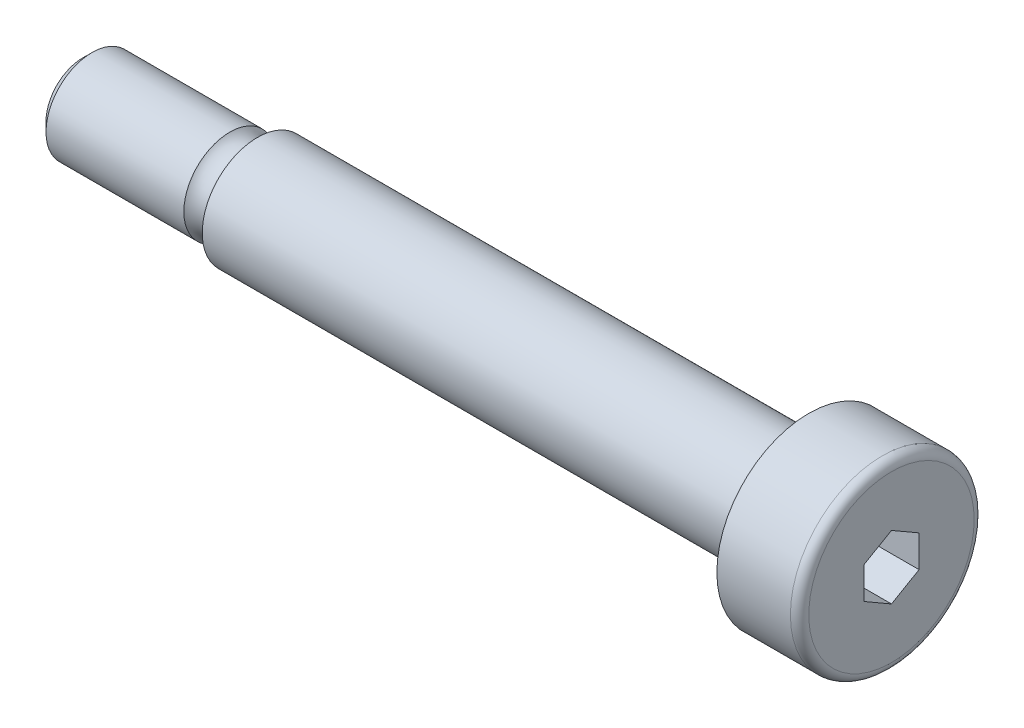
ISO-10303-21;
HEADER;
FILE_DESCRIPTION(('STEP AP214'),'2;1');
FILE_NAME('part.step','',(''),(''),'','','');
FILE_SCHEMA(('AUTOMOTIVE_DESIGN { 1 0 10303 214 1 1 1 1 }'));
ENDSEC;
DATA;
#1=APPLICATION_CONTEXT('core data for automotive mechanical design processes');
#2=APPLICATION_PROTOCOL_DEFINITION('international standard','automotive_design',2000,#1);
#3=PRODUCT_CONTEXT('',#1,'mechanical');
#4=PRODUCT('Part','Part','',(#3));
#5=PRODUCT_RELATED_PRODUCT_CATEGORY('part','',(#4));
#6=PRODUCT_DEFINITION_FORMATION('','',#4);
#7=PRODUCT_DEFINITION_CONTEXT('part definition',#1,'design');
#8=PRODUCT_DEFINITION('design','',#6,#7);
#9=PRODUCT_DEFINITION_SHAPE('','',#8);
#10=(LENGTH_UNIT() NAMED_UNIT(*) SI_UNIT(.MILLI.,.METRE.));
#11=(NAMED_UNIT(*) PLANE_ANGLE_UNIT() SI_UNIT($,.RADIAN.));
#12=(NAMED_UNIT(*) SI_UNIT($,.STERADIAN.) SOLID_ANGLE_UNIT());
#13=UNCERTAINTY_MEASURE_WITH_UNIT(LENGTH_MEASURE(1.E-05),#10,'distance_accuracy_value','');
#14=(GEOMETRIC_REPRESENTATION_CONTEXT(3) GLOBAL_UNCERTAINTY_ASSIGNED_CONTEXT((#13)) GLOBAL_UNIT_ASSIGNED_CONTEXT((#10,
#11,#12)) REPRESENTATION_CONTEXT('',''));
#15=CARTESIAN_POINT('',(0.,0.,0.));
#16=DIRECTION('',(0.,0.,1.));
#17=DIRECTION('',(1.,0.,0.));
#18=AXIS2_PLACEMENT_3D('',#15,#16,#17);
#19=CARTESIAN_POINT('',(0.,0.,0.));
#20=DIRECTION('',(-1.,0.,0.));
#21=DIRECTION('',(0.,0.,-1.));
#22=AXIS2_PLACEMENT_3D('',#19,#20,#21);
#23=PLANE('',#22);
#24=DIRECTION('',(0.,-0.5,0.866025403784438));
#25=VECTOR('',#24,1.);
#26=CARTESIAN_POINT('',(0.,-0.866025403784438,-1.5));
#27=LINE('',#26,#25);
#28=CARTESIAN_POINT('',(0.,-0.866025403784438,-1.5));
#29=VERTEX_POINT('',#28);
#30=CARTESIAN_POINT('',(0.,-1.73205080756888,0.));
#31=VERTEX_POINT('',#30);
#32=EDGE_CURVE('E208',#29,#31,#27,.T.);
#33=ORIENTED_EDGE('',*,*,#32,.T.);
#34=DIRECTION('',(0.,0.5,0.866025403784439));
#35=VECTOR('',#34,1.);
#36=CARTESIAN_POINT('',(0.,-1.73205080756888,0.));
#37=LINE('',#36,#35);
#38=CARTESIAN_POINT('',(0.,-0.866025403784438,1.5));
#39=VERTEX_POINT('',#38);
#40=EDGE_CURVE('E220',#31,#39,#37,.T.);
#41=ORIENTED_EDGE('',*,*,#40,.T.);
#42=DIRECTION('',(0.,1.,0.));
#43=VECTOR('',#42,1.);
#44=CARTESIAN_POINT('',(0.,-0.866025403784438,1.5));
#45=LINE('',#44,#43);
#46=CARTESIAN_POINT('',(0.,0.86602540378444,1.5));
#47=VERTEX_POINT('',#46);
#48=EDGE_CURVE('E223',#39,#47,#45,.T.);
#49=ORIENTED_EDGE('',*,*,#48,.T.);
#50=DIRECTION('',(0.,0.5,-0.866025403784439));
#51=VECTOR('',#50,1.);
#52=CARTESIAN_POINT('',(0.,0.86602540378444,1.5));
#53=LINE('',#52,#51);
#54=CARTESIAN_POINT('',(0.,1.73205080756888,0.));
#55=VERTEX_POINT('',#54);
#56=EDGE_CURVE('E114',#47,#55,#53,.T.);
#57=ORIENTED_EDGE('',*,*,#56,.T.);
#58=DIRECTION('',(0.,-0.5,-0.866025403784439));
#59=VECTOR('',#58,1.);
#60=CARTESIAN_POINT('',(0.,1.73205080756888,0.));
#61=LINE('',#60,#59);
#62=CARTESIAN_POINT('',(0.,0.866025403784439,-1.5));
#63=VERTEX_POINT('',#62);
#64=EDGE_CURVE('E215',#55,#63,#61,.T.);
#65=ORIENTED_EDGE('',*,*,#64,.T.);
#66=DIRECTION('',(0.,-1.,0.));
#67=VECTOR('',#66,1.);
#68=CARTESIAN_POINT('',(0.,0.866025403784439,-1.5));
#69=LINE('',#68,#67);
#70=EDGE_CURVE('E205',#63,#29,#69,.T.);
#71=ORIENTED_EDGE('',*,*,#70,.T.);
#72=EDGE_LOOP('',(#33,#41,#49,#57,#65,#71));
#73=FACE_BOUND('',#72,.T.);
#74=CARTESIAN_POINT('',(0.,0.,0.));
#75=DIRECTION('',(1.,0.,0.));
#76=DIRECTION('',(0.,0.,-1.));
#77=AXIS2_PLACEMENT_3D('',#74,#75,#76);
#78=CIRCLE('',#77,4.5);
#79=CARTESIAN_POINT('',(0.,0.,-4.5));
#80=VERTEX_POINT('',#79);
#81=EDGE_CURVE('E137',#80,#80,#78,.F.);
#82=ORIENTED_EDGE('',*,*,#81,.F.);
#83=EDGE_LOOP('',(#82));
#84=FACE_BOUND('',#83,.T.);
#85=ADVANCED_FACE('F36',(#73,#84),#23,.F.);
#86=CARTESIAN_POINT('',(0.,0.,0.));
#87=DIRECTION('',(-1.,0.,0.));
#88=DIRECTION('',(0.,0.,-1.));
#89=AXIS2_PLACEMENT_3D('',#86,#87,#88);
#90=CYLINDRICAL_SURFACE('',#89,5.);
#91=CARTESIAN_POINT('',(-0.5,0.,0.));
#92=DIRECTION('',(1.,0.,0.));
#93=DIRECTION('',(0.,0.,-1.));
#94=AXIS2_PLACEMENT_3D('',#91,#92,#93);
#95=CIRCLE('',#94,5.);
#96=CARTESIAN_POINT('',(-0.5,0.,-5.));
#97=VERTEX_POINT('',#96);
#98=EDGE_CURVE('E134',#97,#97,#95,.T.);
#99=ORIENTED_EDGE('',*,*,#98,.F.);
#100=EDGE_LOOP('',(#99));
#101=FACE_BOUND('',#100,.T.);
#102=CARTESIAN_POINT('',(-4.5,0.,0.));
#103=DIRECTION('',(1.,0.,0.));
#104=DIRECTION('',(0.,0.,-1.));
#105=AXIS2_PLACEMENT_3D('',#102,#103,#104);
#106=CIRCLE('',#105,5.);
#107=CARTESIAN_POINT('',(-4.5,0.,-5.));
#108=VERTEX_POINT('',#107);
#109=EDGE_CURVE('E131',#108,#108,#106,.T.);
#110=ORIENTED_EDGE('',*,*,#109,.T.);
#111=EDGE_LOOP('',(#110));
#112=FACE_BOUND('',#111,.T.);
#113=ADVANCED_FACE('F158',(#101,#112),#90,.T.);
#114=CARTESIAN_POINT('',(-4.5,5.,0.));
#115=DIRECTION('',(1.,0.,0.));
#116=DIRECTION('',(0.,0.,1.));
#117=AXIS2_PLACEMENT_3D('',#114,#115,#116);
#118=PLANE('',#117);
#119=CARTESIAN_POINT('',(-4.5,0.,0.));
#120=DIRECTION('',(1.,0.,0.));
#121=DIRECTION('',(0.,0.,-1.));
#122=AXIS2_PLACEMENT_3D('',#119,#120,#121);
#123=CIRCLE('',#122,3.);
#124=CARTESIAN_POINT('',(-4.5,0.,-3.));
#125=VERTEX_POINT('',#124);
#126=EDGE_CURVE('E128',#125,#125,#123,.T.);
#127=ORIENTED_EDGE('',*,*,#126,.T.);
#128=EDGE_LOOP('',(#127));
#129=FACE_BOUND('',#128,.T.);
#130=ORIENTED_EDGE('',*,*,#109,.F.);
#131=EDGE_LOOP('',(#130));
#132=FACE_BOUND('',#131,.T.);
#133=ADVANCED_FACE('F164',(#129,#132),#118,.F.);
#134=CARTESIAN_POINT('',(0.,0.,0.));
#135=DIRECTION('',(-1.,0.,0.));
#136=DIRECTION('',(0.,0.,-1.));
#137=AXIS2_PLACEMENT_3D('',#134,#135,#136);
#138=CYLINDRICAL_SURFACE('',#137,3.);
#139=CARTESIAN_POINT('',(-34.5,0.,0.));
#140=DIRECTION('',(1.,0.,0.));
#141=DIRECTION('',(0.,0.,-1.));
#142=AXIS2_PLACEMENT_3D('',#139,#140,#141);
#143=CIRCLE('',#142,3.);
#144=CARTESIAN_POINT('',(-34.5,0.,-3.));
#145=VERTEX_POINT('',#144);
#146=EDGE_CURVE('E125',#145,#145,#143,.T.);
#147=ORIENTED_EDGE('',*,*,#146,.T.);
#148=EDGE_LOOP('',(#147));
#149=FACE_BOUND('',#148,.T.);
#150=ORIENTED_EDGE('',*,*,#126,.F.);
#151=EDGE_LOOP('',(#150));
#152=FACE_BOUND('',#151,.T.);
#153=ADVANCED_FACE('F180',(#149,#152),#138,.T.);
#154=CARTESIAN_POINT('',(-34.5,3.,0.));
#155=DIRECTION('',(1.,0.,0.));
#156=DIRECTION('',(0.,0.,1.));
#157=AXIS2_PLACEMENT_3D('',#154,#155,#156);
#158=PLANE('',#157);
#159=CARTESIAN_POINT('',(-34.5,0.,0.));
#160=DIRECTION('',(-1.,0.,0.));
#161=DIRECTION('',(0.,0.,1.));
#162=AXIS2_PLACEMENT_3D('',#159,#160,#161);
#163=CIRCLE('',#162,2.5);
#164=CARTESIAN_POINT('',(-34.5,0.,2.5));
#165=VERTEX_POINT('',#164);
#166=EDGE_CURVE('E206',#165,#165,#163,.T.);
#167=ORIENTED_EDGE('',*,*,#166,.F.);
#168=EDGE_LOOP('',(#167));
#169=FACE_BOUND('',#168,.T.);
#170=ORIENTED_EDGE('',*,*,#146,.F.);
#171=EDGE_LOOP('',(#170));
#172=FACE_BOUND('',#171,.T.);
#173=ADVANCED_FACE('F173',(#169,#172),#158,.F.);
#174=CARTESIAN_POINT('',(-0.5,0.,0.));
#175=DIRECTION('',(-1.,0.,0.));
#176=DIRECTION('',(0.,0.,-1.));
#177=AXIS2_PLACEMENT_3D('',#174,#175,#176);
#178=TOROIDAL_SURFACE('',#177,4.5,0.5);
#179=ORIENTED_EDGE('',*,*,#81,.T.);
#180=EDGE_LOOP('',(#179));
#181=FACE_BOUND('',#180,.T.);
#182=ORIENTED_EDGE('',*,*,#98,.T.);
#183=EDGE_LOOP('',(#182));
#184=FACE_BOUND('',#183,.T.);
#185=ADVANCED_FACE('F170',(#181,#184),#178,.T.);
#186=CARTESIAN_POINT('',(-5.,0.866025403784439,-1.5));
#187=DIRECTION('',(0.,0.,-1.));
#188=DIRECTION('',(0.,-1.,0.));
#189=AXIS2_PLACEMENT_3D('',#186,#187,#188);
#190=PLANE('',#189);
#191=ORIENTED_EDGE('',*,*,#70,.F.);
#192=DIRECTION('',(1.,0.,0.));
#193=VECTOR('',#192,1.);
#194=CARTESIAN_POINT('',(-5.,0.866025403784439,-1.5));
#195=LINE('',#194,#193);
#196=CARTESIAN_POINT('',(-5.,0.866025403784439,-1.5));
#197=VERTEX_POINT('',#196);
#198=EDGE_CURVE('E82',#197,#63,#195,.T.);
#199=ORIENTED_EDGE('',*,*,#198,.F.);
#200=DIRECTION('',(0.,-1.,0.));
#201=VECTOR('',#200,1.);
#202=CARTESIAN_POINT('',(-5.,0.866025403784439,-1.5));
#203=LINE('',#202,#201);
#204=CARTESIAN_POINT('',(-5.,-0.866025403784438,-1.5));
#205=VERTEX_POINT('',#204);
#206=EDGE_CURVE('E213',#197,#205,#203,.T.);
#207=ORIENTED_EDGE('',*,*,#206,.T.);
#208=DIRECTION('',(1.,0.,0.));
#209=VECTOR('',#208,1.);
#210=CARTESIAN_POINT('',(-5.,-0.866025403784438,-1.5));
#211=LINE('',#210,#209);
#212=EDGE_CURVE('E51',#205,#29,#211,.T.);
#213=ORIENTED_EDGE('',*,*,#212,.T.);
#214=EDGE_LOOP('',(#191,#199,#207,#213));
#215=FACE_BOUND('',#214,.T.);
#216=ADVANCED_FACE('F172',(#215),#190,.F.);
#217=CARTESIAN_POINT('',(-5.,1.73205080756888,0.));
#218=DIRECTION('',(0.,0.866025403784439,-0.5));
#219=DIRECTION('',(0.,-0.5,-0.866025403784439));
#220=AXIS2_PLACEMENT_3D('',#217,#218,#219);
#221=PLANE('',#220);
#222=ORIENTED_EDGE('',*,*,#64,.F.);
#223=DIRECTION('',(1.,0.,0.));
#224=VECTOR('',#223,1.);
#225=CARTESIAN_POINT('',(-5.,1.73205080756888,0.));
#226=LINE('',#225,#224);
#227=CARTESIAN_POINT('',(-5.,1.73205080756888,0.));
#228=VERTEX_POINT('',#227);
#229=EDGE_CURVE('E116',#228,#55,#226,.T.);
#230=ORIENTED_EDGE('',*,*,#229,.F.);
#231=DIRECTION('',(0.,-0.5,-0.866025403784439));
#232=VECTOR('',#231,1.);
#233=CARTESIAN_POINT('',(-5.,1.73205080756888,0.));
#234=LINE('',#233,#232);
#235=EDGE_CURVE('E60',#228,#197,#234,.T.);
#236=ORIENTED_EDGE('',*,*,#235,.T.);
#237=ORIENTED_EDGE('',*,*,#198,.T.);
#238=EDGE_LOOP('',(#222,#230,#236,#237));
#239=FACE_BOUND('',#238,.T.);
#240=ADVANCED_FACE('F179',(#239),#221,.F.);
#241=CARTESIAN_POINT('',(-5.,0.86602540378444,1.5));
#242=DIRECTION('',(0.,0.866025403784439,0.5));
#243=DIRECTION('',(0.,0.5,-0.866025403784439));
#244=AXIS2_PLACEMENT_3D('',#241,#242,#243);
#245=PLANE('',#244);
#246=ORIENTED_EDGE('',*,*,#56,.F.);
#247=DIRECTION('',(1.,0.,0.));
#248=VECTOR('',#247,1.);
#249=CARTESIAN_POINT('',(-5.,0.86602540378444,1.5));
#250=LINE('',#249,#248);
#251=CARTESIAN_POINT('',(-5.,0.86602540378444,1.5));
#252=VERTEX_POINT('',#251);
#253=EDGE_CURVE('E103',#252,#47,#250,.T.);
#254=ORIENTED_EDGE('',*,*,#253,.F.);
#255=DIRECTION('',(0.,0.5,-0.866025403784439));
#256=VECTOR('',#255,1.);
#257=CARTESIAN_POINT('',(-5.,0.86602540378444,1.5));
#258=LINE('',#257,#256);
#259=EDGE_CURVE('E106',#252,#228,#258,.T.);
#260=ORIENTED_EDGE('',*,*,#259,.T.);
#261=ORIENTED_EDGE('',*,*,#229,.T.);
#262=EDGE_LOOP('',(#246,#254,#260,#261));
#263=FACE_BOUND('',#262,.T.);
#264=ADVANCED_FACE('F112',(#263),#245,.F.);
#265=CARTESIAN_POINT('',(-5.,-0.866025403784438,1.5));
#266=DIRECTION('',(0.,0.,1.));
#267=DIRECTION('',(-1.,0.,0.));
#268=AXIS2_PLACEMENT_3D('',#265,#266,#267);
#269=PLANE('',#268);
#270=ORIENTED_EDGE('',*,*,#48,.F.);
#271=DIRECTION('',(1.,0.,0.));
#272=VECTOR('',#271,1.);
#273=CARTESIAN_POINT('',(-5.,-0.866025403784438,1.5));
#274=LINE('',#273,#272);
#275=CARTESIAN_POINT('',(-5.,-0.866025403784438,1.5));
#276=VERTEX_POINT('',#275);
#277=EDGE_CURVE('E105',#276,#39,#274,.T.);
#278=ORIENTED_EDGE('',*,*,#277,.F.);
#279=DIRECTION('',(0.,1.,0.));
#280=VECTOR('',#279,1.);
#281=CARTESIAN_POINT('',(-5.,-0.866025403784438,1.5));
#282=LINE('',#281,#280);
#283=EDGE_CURVE('E98',#276,#252,#282,.T.);
#284=ORIENTED_EDGE('',*,*,#283,.T.);
#285=ORIENTED_EDGE('',*,*,#253,.T.);
#286=EDGE_LOOP('',(#270,#278,#284,#285));
#287=FACE_BOUND('',#286,.T.);
#288=ADVANCED_FACE('F101',(#287),#269,.F.);
#289=CARTESIAN_POINT('',(-5.,-1.73205080756888,0.));
#290=DIRECTION('',(0.,-0.866025403784438,0.5));
#291=DIRECTION('',(0.,0.5,0.866025403784438));
#292=AXIS2_PLACEMENT_3D('',#289,#290,#291);
#293=PLANE('',#292);
#294=ORIENTED_EDGE('',*,*,#40,.F.);
#295=DIRECTION('',(1.,0.,0.));
#296=VECTOR('',#295,1.);
#297=CARTESIAN_POINT('',(-5.,-1.73205080756888,0.));
#298=LINE('',#297,#296);
#299=CARTESIAN_POINT('',(-5.,-1.73205080756888,0.));
#300=VERTEX_POINT('',#299);
#301=EDGE_CURVE('E119',#300,#31,#298,.T.);
#302=ORIENTED_EDGE('',*,*,#301,.F.);
#303=DIRECTION('',(0.,0.5,0.866025403784439));
#304=VECTOR('',#303,1.);
#305=CARTESIAN_POINT('',(-5.,-1.73205080756888,0.));
#306=LINE('',#305,#304);
#307=EDGE_CURVE('E107',#300,#276,#306,.T.);
#308=ORIENTED_EDGE('',*,*,#307,.T.);
#309=ORIENTED_EDGE('',*,*,#277,.T.);
#310=EDGE_LOOP('',(#294,#302,#308,#309));
#311=FACE_BOUND('',#310,.T.);
#312=ADVANCED_FACE('F238',(#311),#293,.F.);
#313=CARTESIAN_POINT('',(-5.,-0.866025403784438,-1.5));
#314=DIRECTION('',(0.,-0.866025403784438,-0.5));
#315=DIRECTION('',(0.,-0.5,0.866025403784439));
#316=AXIS2_PLACEMENT_3D('',#313,#314,#315);
#317=PLANE('',#316);
#318=ORIENTED_EDGE('',*,*,#32,.F.);
#319=ORIENTED_EDGE('',*,*,#212,.F.);
#320=DIRECTION('',(0.,-0.5,0.866025403784438));
#321=VECTOR('',#320,1.);
#322=CARTESIAN_POINT('',(-5.,-0.866025403784438,-1.5));
#323=LINE('',#322,#321);
#324=EDGE_CURVE('E89',#205,#300,#323,.T.);
#325=ORIENTED_EDGE('',*,*,#324,.T.);
#326=ORIENTED_EDGE('',*,*,#301,.T.);
#327=EDGE_LOOP('',(#318,#319,#325,#326));
#328=FACE_BOUND('',#327,.T.);
#329=ADVANCED_FACE('F241',(#328),#317,.F.);
#330=CARTESIAN_POINT('',(-5.,0.,0.));
#331=DIRECTION('',(1.,0.,0.));
#332=DIRECTION('',(0.,0.,1.));
#333=AXIS2_PLACEMENT_3D('',#330,#331,#332);
#334=PLANE('',#333);
#335=ORIENTED_EDGE('',*,*,#206,.F.);
#336=ORIENTED_EDGE('',*,*,#235,.F.);
#337=ORIENTED_EDGE('',*,*,#259,.F.);
#338=ORIENTED_EDGE('',*,*,#283,.F.);
#339=ORIENTED_EDGE('',*,*,#307,.F.);
#340=ORIENTED_EDGE('',*,*,#324,.F.);
#341=EDGE_LOOP('',(#335,#336,#337,#338,#339,#340));
#342=FACE_BOUND('',#341,.T.);
#343=ADVANCED_FACE('F109',(#342),#334,.T.);
#344=CARTESIAN_POINT('',(-35.25,0.,0.));
#345=DIRECTION('',(1.,0.,0.));
#346=DIRECTION('',(0.,0.,1.));
#347=AXIS2_PLACEMENT_3D('',#344,#345,#346);
#348=TOROIDAL_SURFACE('',#347,3.16143782776615,1.);
#349=CARTESIAN_POINT('',(-36.,0.,0.));
#350=DIRECTION('',(-1.,0.,0.));
#351=DIRECTION('',(0.,0.,1.));
#352=AXIS2_PLACEMENT_3D('',#349,#350,#351);
#353=CIRCLE('',#352,2.5);
#354=CARTESIAN_POINT('',(-36.,0.,2.5));
#355=VERTEX_POINT('',#354);
#356=EDGE_CURVE('E204',#355,#355,#353,.T.);
#357=ORIENTED_EDGE('',*,*,#356,.F.);
#358=EDGE_LOOP('',(#357));
#359=FACE_BOUND('',#358,.T.);
#360=ORIENTED_EDGE('',*,*,#166,.T.);
#361=EDGE_LOOP('',(#360));
#362=FACE_BOUND('',#361,.T.);
#363=ADVANCED_FACE('F145',(#359,#362),#348,.F.);
#364=CARTESIAN_POINT('',(-44.,2.5,0.));
#365=DIRECTION('',(1.,0.,0.));
#366=DIRECTION('',(0.,0.,1.));
#367=AXIS2_PLACEMENT_3D('',#364,#365,#366);
#368=PLANE('',#367);
#369=CARTESIAN_POINT('',(-44.,0.,0.));
#370=DIRECTION('',(-1.,0.,0.));
#371=DIRECTION('',(0.,0.,1.));
#372=AXIS2_PLACEMENT_3D('',#369,#370,#371);
#373=CIRCLE('',#372,1.99999999999999);
#374=CARTESIAN_POINT('',(-44.,0.,1.99999999999999));
#375=VERTEX_POINT('',#374);
#376=EDGE_CURVE('E44',#375,#375,#373,.F.);
#377=ORIENTED_EDGE('',*,*,#376,.F.);
#378=EDGE_LOOP('',(#377));
#379=FACE_BOUND('',#378,.T.);
#380=ADVANCED_FACE('F143',(#379),#368,.F.);
#381=CARTESIAN_POINT('',(-44.,0.,0.));
#382=DIRECTION('',(1.,0.,0.));
#383=DIRECTION('',(0.,0.,1.));
#384=AXIS2_PLACEMENT_3D('',#381,#382,#383);
#385=CONICAL_SURFACE('',#384,1.99999999999999,0.785398163397452);
#386=CARTESIAN_POINT('',(-43.5,0.,0.));
#387=DIRECTION('',(-1.,0.,0.));
#388=DIRECTION('',(0.,0.,1.));
#389=AXIS2_PLACEMENT_3D('',#386,#387,#388);
#390=CIRCLE('',#389,2.5);
#391=CARTESIAN_POINT('',(-43.5,0.,2.5));
#392=VERTEX_POINT('',#391);
#393=EDGE_CURVE('E11',#392,#392,#390,.T.);
#394=ORIENTED_EDGE('',*,*,#393,.T.);
#395=EDGE_LOOP('',(#394));
#396=FACE_BOUND('',#395,.T.);
#397=ORIENTED_EDGE('',*,*,#376,.T.);
#398=EDGE_LOOP('',(#397));
#399=FACE_BOUND('',#398,.T.);
#400=ADVANCED_FACE('F38',(#396,#399),#385,.T.);
#401=CARTESIAN_POINT('',(0.,0.,0.));
#402=DIRECTION('',(-1.,0.,0.));
#403=DIRECTION('',(0.,0.,-1.));
#404=AXIS2_PLACEMENT_3D('',#401,#402,#403);
#405=CYLINDRICAL_SURFACE('',#404,2.5);
#406=ORIENTED_EDGE('',*,*,#393,.F.);
#407=EDGE_LOOP('',(#406));
#408=FACE_BOUND('',#407,.T.);
#409=ORIENTED_EDGE('',*,*,#356,.T.);
#410=EDGE_LOOP('',(#409));
#411=FACE_BOUND('',#410,.T.);
#412=ADVANCED_FACE('F151',(#408,#411),#405,.T.);
#413=CLOSED_SHELL('',(#85,#113,#133,#153,#173,#185,#216,#240,#264,#288,#312,#329,#343,#363,#380,
#400,#412));
#414=MANIFOLD_SOLID_BREP('B2',#413);
#415=ADVANCED_BREP_SHAPE_REPRESENTATION('',(#18,#414),#14);
#416=SHAPE_DEFINITION_REPRESENTATION(#9,#415);
ENDSEC;
END-ISO-10303-21;
